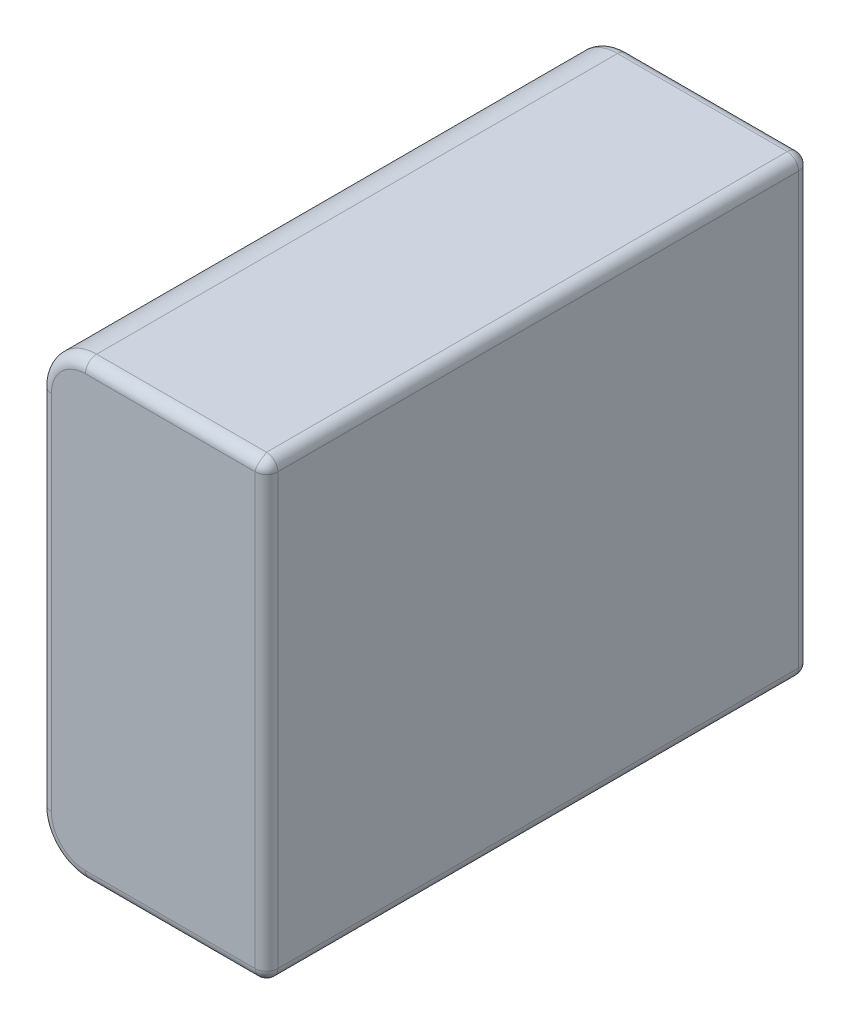
ISO-10303-21;
HEADER;
FILE_DESCRIPTION(('STEP AP214'),'2;1');
FILE_NAME('part.step','',(''),(''),'','','');
FILE_SCHEMA(('AUTOMOTIVE_DESIGN { 1 0 10303 214 1 1 1 1 }'));
ENDSEC;
DATA;
#1=APPLICATION_CONTEXT('core data for automotive mechanical design processes');
#2=APPLICATION_PROTOCOL_DEFINITION('international standard','automotive_design',2000,#1);
#3=PRODUCT_CONTEXT('',#1,'mechanical');
#4=PRODUCT('Part','Part','',(#3));
#5=PRODUCT_RELATED_PRODUCT_CATEGORY('part','',(#4));
#6=PRODUCT_DEFINITION_FORMATION('','',#4);
#7=PRODUCT_DEFINITION_CONTEXT('part definition',#1,'design');
#8=PRODUCT_DEFINITION('design','',#6,#7);
#9=PRODUCT_DEFINITION_SHAPE('','',#8);
#10=(LENGTH_UNIT() NAMED_UNIT(*) SI_UNIT(.MILLI.,.METRE.));
#11=(NAMED_UNIT(*) PLANE_ANGLE_UNIT() SI_UNIT($,.RADIAN.));
#12=(NAMED_UNIT(*) SI_UNIT($,.STERADIAN.) SOLID_ANGLE_UNIT());
#13=UNCERTAINTY_MEASURE_WITH_UNIT(LENGTH_MEASURE(1.E-05),#10,'distance_accuracy_value','');
#14=(GEOMETRIC_REPRESENTATION_CONTEXT(3) GLOBAL_UNCERTAINTY_ASSIGNED_CONTEXT((#13)) GLOBAL_UNIT_ASSIGNED_CONTEXT((#10,
#11,#12)) REPRESENTATION_CONTEXT('',''));
#15=CARTESIAN_POINT('',(0.,0.,0.));
#16=DIRECTION('',(0.,0.,1.));
#17=DIRECTION('',(1.,0.,0.));
#18=AXIS2_PLACEMENT_3D('',#15,#16,#17);
#19=CARTESIAN_POINT('',(-0.262499999999999,-0.125,0.587499999999999));
#20=DIRECTION('',(0.,1.,0.));
#21=DIRECTION('',(0.707106781186548,0.,0.707106781186548));
#22=AXIS2_PLACEMENT_3D('',#19,#20,#21);
#23=CYLINDRICAL_SURFACE('',#22,0.0125);
#24=CARTESIAN_POINT('',(-0.262499999999999,-0.2375,0.587499999999999));
#25=DIRECTION('',(0.,1.,0.));
#26=DIRECTION('',(0.,0.,1.));
#27=AXIS2_PLACEMENT_3D('',#24,#25,#26);
#28=CIRCLE('',#27,0.0125);
#29=CARTESIAN_POINT('',(-0.262499999999999,-0.2375,0.6));
#30=VERTEX_POINT('',#29);
#31=CARTESIAN_POINT('',(-0.25,-0.2375,0.587499999999999));
#32=VERTEX_POINT('',#31);
#33=EDGE_CURVE('E11',#30,#32,#28,.T.);
#34=ORIENTED_EDGE('',*,*,#33,.T.);
#35=DIRECTION('',(0.,1.,0.));
#36=VECTOR('',#35,1.);
#37=CARTESIAN_POINT('',(-0.25,-0.125,0.587499999999999));
#38=LINE('',#37,#36);
#39=CARTESIAN_POINT('',(-0.25,0.2375,0.587499999999999));
#40=VERTEX_POINT('',#39);
#41=EDGE_CURVE('E24',#32,#40,#38,.T.);
#42=ORIENTED_EDGE('',*,*,#41,.T.);
#43=CARTESIAN_POINT('',(-0.262500000000002,0.2375,0.587499999999999));
#44=DIRECTION('',(0.,-1.,0.));
#45=DIRECTION('',(1.,0.,0.));
#46=AXIS2_PLACEMENT_3D('',#43,#44,#45);
#47=CIRCLE('',#46,0.0125);
#48=CARTESIAN_POINT('',(-0.262500000000002,0.2375,0.6));
#49=VERTEX_POINT('',#48);
#50=EDGE_CURVE('E478',#40,#49,#47,.T.);
#51=ORIENTED_EDGE('',*,*,#50,.T.);
#52=DIRECTION('',(0.,-1.,0.));
#53=VECTOR('',#52,1.);
#54=CARTESIAN_POINT('',(-0.262499999999999,-0.125,0.6));
#55=LINE('',#54,#53);
#56=EDGE_CURVE('E480',#49,#30,#55,.T.);
#57=ORIENTED_EDGE('',*,*,#56,.T.);
#58=EDGE_LOOP('',(#34,#42,#51,#57));
#59=FACE_BOUND('',#58,.T.);
#60=ADVANCED_FACE('F17',(#59),#23,.T.);
#61=CARTESIAN_POINT('',(-0.262500000000002,0.2375,0.));
#62=DIRECTION('',(0.,0.,1.));
#63=DIRECTION('',(0.707106781186548,0.707106781186548,0.));
#64=AXIS2_PLACEMENT_3D('',#61,#62,#63);
#65=CYLINDRICAL_SURFACE('',#64,0.0125);
#66=CARTESIAN_POINT('',(-0.262500000000002,0.2375,0.0125));
#67=DIRECTION('',(0.,0.,1.));
#68=DIRECTION('',(1.,0.,0.));
#69=AXIS2_PLACEMENT_3D('',#66,#67,#68);
#70=CIRCLE('',#69,0.0125);
#71=CARTESIAN_POINT('',(-0.25,0.2375,0.0125));
#72=VERTEX_POINT('',#71);
#73=CARTESIAN_POINT('',(-0.262500000000002,0.25,0.0125));
#74=VERTEX_POINT('',#73);
#75=EDGE_CURVE('E328',#72,#74,#70,.T.);
#76=ORIENTED_EDGE('',*,*,#75,.T.);
#77=DIRECTION('',(0.,0.,1.));
#78=VECTOR('',#77,1.);
#79=CARTESIAN_POINT('',(-0.262500000000002,0.25,0.));
#80=LINE('',#79,#78);
#81=CARTESIAN_POINT('',(-0.262500000000002,0.25,0.587499999999999));
#82=VERTEX_POINT('',#81);
#83=EDGE_CURVE('E326',#74,#82,#80,.T.);
#84=ORIENTED_EDGE('',*,*,#83,.T.);
#85=CARTESIAN_POINT('',(-0.262500000000002,0.2375,0.587499999999999));
#86=DIRECTION('',(0.,0.,-1.));
#87=DIRECTION('',(0.,1.,0.));
#88=AXIS2_PLACEMENT_3D('',#85,#86,#87);
#89=CIRCLE('',#88,0.0125);
#90=EDGE_CURVE('E311',#82,#40,#89,.T.);
#91=ORIENTED_EDGE('',*,*,#90,.T.);
#92=DIRECTION('',(0.,0.,-1.));
#93=VECTOR('',#92,1.);
#94=CARTESIAN_POINT('',(-0.25,0.2375,0.));
#95=LINE('',#94,#93);
#96=EDGE_CURVE('E301',#40,#72,#95,.T.);
#97=ORIENTED_EDGE('',*,*,#96,.T.);
#98=EDGE_LOOP('',(#76,#84,#91,#97));
#99=FACE_BOUND('',#98,.T.);
#100=ADVANCED_FACE('F290',(#99),#65,.T.);
#101=CARTESIAN_POINT('',(-0.262500000000002,0.2375,0.587499999999999));
#102=DIRECTION('',(0.408248290463862,-0.816496580927725,0.408248290463866));
#103=DIRECTION('',(0.577350269189625,0.577350269189627,0.577350269189625));
#104=AXIS2_PLACEMENT_3D('',#101,#102,#103);
#105=SPHERICAL_SURFACE('',#104,0.0125);
#106=ORIENTED_EDGE('',*,*,#90,.F.);
#107=CARTESIAN_POINT('',(-0.262500000000002,0.25,0.587499999999999));
#108=CARTESIAN_POINT('',(-0.262460138317171,0.250000000368975,0.587587050235732));
#109=CARTESIAN_POINT('',(-0.262421203756531,0.249998900018879,0.587674523833041));
#110=CARTESIAN_POINT('',(-0.26234504080401,0.249994492376857,0.587850542882255));
#111=CARTESIAN_POINT('',(-0.262307819307045,0.249991176880227,0.587939091112898));
#112=CARTESIAN_POINT('',(-0.262235095454046,0.249982316901602,0.588117167164209));
#113=CARTESIAN_POINT('',(-0.262199600052556,0.249976764124813,0.588206697410652));
#114=CARTESIAN_POINT('',(-0.262130337871806,0.249963409840881,0.588386644833031));
#115=CARTESIAN_POINT('',(-0.262096578078579,0.249955599974056,0.588477064076424));
#116=CARTESIAN_POINT('',(-0.262030794145388,0.249937713377954,0.58865869603542));
#117=CARTESIAN_POINT('',(-0.261998776998999,0.249927628246524,0.588749910455609));
#118=CARTESIAN_POINT('',(-0.261936482752682,0.249905174938278,0.588933038355466));
#119=CARTESIAN_POINT('',(-0.26190621262967,0.249892798340192,0.589024953173915));
#120=CARTESIAN_POINT('',(-0.261847413889721,0.249865747441945,0.589209388185488));
#121=CARTESIAN_POINT('',(-0.261818892208327,0.249851064722725,0.589301909357091));
#122=CARTESIAN_POINT('',(-0.261763590279557,0.249819390038736,0.589487458151079));
#123=CARTESIAN_POINT('',(-0.261736816907599,0.249802389683842,0.589580486376875));
#124=CARTESIAN_POINT('',(-0.261658961292165,0.249747807237126,0.589860703073068));
#125=CARTESIAN_POINT('',(-0.261610664068412,0.249706791423579,0.59004801510688));
#126=CARTESIAN_POINT('',(-0.261520937759418,0.249615450455052,0.590423514884361));
#127=CARTESIAN_POINT('',(-0.261479561150397,0.249565059797937,0.590611699096358));
#128=CARTESIAN_POINT('',(-0.261403570620227,0.249454937117288,0.590988196284548));
#129=CARTESIAN_POINT('',(-0.261369006675153,0.249395141456735,0.591176500731737));
#130=CARTESIAN_POINT('',(-0.261306502098158,0.249266213002719,0.591552473817965));
#131=CARTESIAN_POINT('',(-0.261278608471858,0.249197019038733,0.591740129259613));
#132=CARTESIAN_POINT('',(-0.261229264257322,0.249049330723359,0.592114052021967));
#133=CARTESIAN_POINT('',(-0.261207857266753,0.248970778177699,0.592300302086986));
#134=CARTESIAN_POINT('',(-0.26117126850462,0.24880444368912,0.592670670223809));
#135=CARTESIAN_POINT('',(-0.261156126594544,0.248716606981504,0.592854767614381));
#136=CARTESIAN_POINT('',(-0.261131813442202,0.248531809467501,0.593220100228458));
#137=CARTESIAN_POINT('',(-0.261122678089061,0.248434797708901,0.59340131204606));
#138=CARTESIAN_POINT('',(-0.261110088515226,0.248231790024816,0.593760159765119));
#139=CARTESIAN_POINT('',(-0.261106666071686,0.248125747272619,0.593937770271813));
#140=CARTESIAN_POINT('',(-0.261105179530546,0.247904852225839,0.594288721361308));
#141=CARTESIAN_POINT('',(-0.261107143051624,0.247789957471335,0.594462035319713));
#142=CARTESIAN_POINT('',(-0.261116074367314,0.247551567669741,0.594803722087146));
#143=CARTESIAN_POINT('',(-0.261123065665332,0.247428034699039,0.594972067809081));
#144=CARTESIAN_POINT('',(-0.261141669295437,0.247172612106419,0.595303172639523));
#145=CARTESIAN_POINT('',(-0.261153301143513,0.247040689195444,0.595465904959755));
#146=CARTESIAN_POINT('',(-0.261180775747745,0.246768764364797,0.595785166124085));
#147=CARTESIAN_POINT('',(-0.261196634239012,0.246628733818788,0.595941669222561));
#148=CARTESIAN_POINT('',(-0.261232127542683,0.246340904812075,0.596247886384845));
#149=CARTESIAN_POINT('',(-0.261251774587734,0.24619308234755,0.596397576460868));
#150=CARTESIAN_POINT('',(-0.261294388510575,0.245890013342245,0.596689615871231));
#151=CARTESIAN_POINT('',(-0.261317364461382,0.245734747313759,0.596831943652332));
#152=CARTESIAN_POINT('',(-0.261366160485632,0.245417166900696,0.59710874299751));
#153=CARTESIAN_POINT('',(-0.261391986871758,0.245254837374504,0.597243196072397));
#154=CARTESIAN_POINT('',(-0.261445991620957,0.244923536552346,0.59750376896212));
#155=CARTESIAN_POINT('',(-0.261474173983779,0.244754554230126,0.597629873926419));
#156=CARTESIAN_POINT('',(-0.26153238498295,0.244410384103418,0.59787331399446));
#157=CARTESIAN_POINT('',(-0.261562415792964,0.244235189099866,0.597990638399316));
#158=CARTESIAN_POINT('',(-0.26162380737987,0.243879058289113,0.598216123000334));
#159=CARTESIAN_POINT('',(-0.261655169021759,0.24369811876801,0.598324277094838));
#160=CARTESIAN_POINT('',(-0.261718698378142,0.243330990541526,0.598531070579969));
#161=CARTESIAN_POINT('',(-0.261750866187902,0.243144801215446,0.598629708839366));
#162=CARTESIAN_POINT('',(-0.261815479459071,0.242767690354468,0.598817165396053));
#163=CARTESIAN_POINT('',(-0.261847924797288,0.24257677085445,0.59890598782922));
#164=CARTESIAN_POINT('',(-0.261912563267763,0.242190740263042,0.599073553871494));
#165=CARTESIAN_POINT('',(-0.261944756612733,0.241995633383472,0.599152307100366));
#166=CARTESIAN_POINT('',(-0.26200836290602,0.241601790460795,0.599299523203508));
#167=CARTESIAN_POINT('',(-0.262039776951108,0.241403060291862,0.599368001315687));
#168=CARTESIAN_POINT('',(-0.262101301219288,0.241002553067784,0.599494503671092));
#169=CARTESIAN_POINT('',(-0.262131413955845,0.240800783004186,0.599552548820256));
#170=CARTESIAN_POINT('',(-0.262189820033099,0.240394796106706,0.599658070264641));
#171=CARTESIAN_POINT('',(-0.262218117811786,0.240190586812288,0.599705573098087));
#172=CARTESIAN_POINT('',(-0.262272389274939,0.239780337089305,0.599789943490852));
#173=CARTESIAN_POINT('',(-0.262298369795825,0.239574304161341,0.599826843099588));
#174=CARTESIAN_POINT('',(-0.262347515991668,0.239161036698738,0.599889989875639));
#175=CARTESIAN_POINT('',(-0.262370691332091,0.238953809026519,0.599916274394815));
#176=CARTESIAN_POINT('',(-0.262413752999642,0.238538790892885,0.599958220217014));
#177=CARTESIAN_POINT('',(-0.262433652201096,0.238331006062188,0.599973923891259));
#178=CARTESIAN_POINT('',(-0.262469707922112,0.237915527781207,0.599994792829387));
#179=CARTESIAN_POINT('',(-0.262485880839781,0.237707838106917,0.600000005078491));
#180=CARTESIAN_POINT('',(-0.262500000000002,0.2375,0.6));
#181=B_SPLINE_CURVE_WITH_KNOTS('',3,(#107,#108,#109,#110,#111,#112,#113,#114,#115,#116,#117,
#118,#119,#120,#121,#122,#123,#124,#125,#126,#127,#128,#129,#130,#131,#132,#133,#134,#135,#136,
#137,#138,#139,#140,#141,#142,#143,#144,#145,#146,#147,#148,#149,#150,#151,#152,#153,#154,#155,
#156,#157,#158,#159,#160,#161,#162,#163,#164,#165,#166,#167,#168,#169,#170,#171,#172,#173,#174,
#175,#176,#177,#178,#179,#180),.UNSPECIFIED.,.F.,.F.,(4,2,2,2,2,2,2,2,2,2,2,2,2,2,2,2,2,2,2,2,2,
2,2,2,2,2,2,2,2,2,2,2,2,2,2,2,4),(0.,0.000287215319437022,0.000575500400044878,
0.000864864290064689,0.00115531395410053,0.00144685428334177,0.00173948810969325,
0.00203321622360352,0.00232803739539121,0.00292087989864206,0.00351803175637727,
0.0041194132520295,0.00472491540580101,0.00533440129988855,0.00594770752489346,
0.00656464572958198,0.00718500425813863,0.00780854986095383,0.008435029466779,
0.00906417200571993,0.00969569027402575,0.010329282832943,0.0109646359350514,0.0116014254724792,
0.0122393189422204,0.012877977424449,0.0135170575702609,0.0141562135956687,0.0147950992789479,
0.0154333699585787,0.0160706845290551,0.0167067074317385,0.0173411106377146,0.0179735756192771,
0.0186037953061802,0.0192314760221985,0.0198563393967707),.UNSPECIFIED.);
#182=EDGE_CURVE('E273',#82,#49,#181,.T.);
#183=ORIENTED_EDGE('',*,*,#182,.T.);
#184=ORIENTED_EDGE('',*,*,#50,.F.);
#185=EDGE_LOOP('',(#106,#183,#184));
#186=FACE_BOUND('',#185,.T.);
#187=ADVANCED_FACE('F280',(#186),#105,.T.);
#188=CARTESIAN_POINT('',(-0.262499999999999,-0.125,0.0125));
#189=DIRECTION('',(0.,1.,0.));
#190=DIRECTION('',(0.707106781186548,0.,-0.707106781186547));
#191=AXIS2_PLACEMENT_3D('',#188,#189,#190);
#192=CYLINDRICAL_SURFACE('',#191,0.0125);
#193=CARTESIAN_POINT('',(-0.262499999999999,-0.2375,0.0125));
#194=DIRECTION('',(0.,1.,0.));
#195=DIRECTION('',(1.,0.,0.));
#196=AXIS2_PLACEMENT_3D('',#193,#194,#195);
#197=CIRCLE('',#196,0.0125);
#198=CARTESIAN_POINT('',(-0.25,-0.2375,0.0125));
#199=VERTEX_POINT('',#198);
#200=CARTESIAN_POINT('',(-0.262499999999999,-0.2375,0.));
#201=VERTEX_POINT('',#200);
#202=EDGE_CURVE('E381',#199,#201,#197,.T.);
#203=ORIENTED_EDGE('',*,*,#202,.T.);
#204=DIRECTION('',(0.,1.,0.));
#205=VECTOR('',#204,1.);
#206=CARTESIAN_POINT('',(-0.262499999999999,-0.125,0.));
#207=LINE('',#206,#205);
#208=CARTESIAN_POINT('',(-0.262500000000002,0.2375,0.));
#209=VERTEX_POINT('',#208);
#210=EDGE_CURVE('E379',#201,#209,#207,.T.);
#211=ORIENTED_EDGE('',*,*,#210,.T.);
#212=CARTESIAN_POINT('',(-0.262499999999999,0.2375,0.0125));
#213=DIRECTION('',(0.,-1.,0.));
#214=DIRECTION('',(-1.95156391047391E-13,0.,-1.));
#215=AXIS2_PLACEMENT_3D('',#212,#213,#214);
#216=CIRCLE('',#215,0.0125);
#217=EDGE_CURVE('E363',#209,#72,#216,.T.);
#218=ORIENTED_EDGE('',*,*,#217,.T.);
#219=DIRECTION('',(0.,-1.,0.));
#220=VECTOR('',#219,1.);
#221=CARTESIAN_POINT('',(-0.25,-0.125,0.0125));
#222=LINE('',#221,#220);
#223=EDGE_CURVE('E352',#72,#199,#222,.T.);
#224=ORIENTED_EDGE('',*,*,#223,.T.);
#225=EDGE_LOOP('',(#203,#211,#218,#224));
#226=FACE_BOUND('',#225,.T.);
#227=ADVANCED_FACE('F289',(#226),#192,.T.);
#228=CARTESIAN_POINT('',(-0.262500000000002,0.2375,0.0125));
#229=DIRECTION('',(-0.816496580927726,0.408248290463863,-0.408248290463864));
#230=DIRECTION('',(0.577350269189626,0.577350269189626,-0.577350269189626));
#231=AXIS2_PLACEMENT_3D('',#228,#229,#230);
#232=SPHERICAL_SURFACE('',#231,0.0125);
#233=ORIENTED_EDGE('',*,*,#217,.F.);
#234=CARTESIAN_POINT('',(-0.262500000000002,0.2375,0.0125));
#235=DIRECTION('',(1.,0.,0.));
#236=DIRECTION('',(0.,0.707106781186548,-0.707106781186547));
#237=AXIS2_PLACEMENT_3D('',#234,#235,#236);
#238=CIRCLE('',#237,0.0125);
#239=EDGE_CURVE('E430',#209,#74,#238,.T.);
#240=ORIENTED_EDGE('',*,*,#239,.T.);
#241=ORIENTED_EDGE('',*,*,#75,.F.);
#242=EDGE_LOOP('',(#233,#240,#241));
#243=FACE_BOUND('',#242,.T.);
#244=ADVANCED_FACE('F333',(#243),#232,.T.);
#245=CARTESIAN_POINT('',(-0.262499999999999,-0.2375,0.));
#246=DIRECTION('',(0.,0.,1.));
#247=DIRECTION('',(0.707106781186548,-0.707106781186548,0.));
#248=AXIS2_PLACEMENT_3D('',#245,#246,#247);
#249=CYLINDRICAL_SURFACE('',#248,0.0125);
#250=CARTESIAN_POINT('',(-0.262499999999999,-0.2375,0.0125));
#251=DIRECTION('',(0.,0.,1.));
#252=DIRECTION('',(0.,-1.,0.));
#253=AXIS2_PLACEMENT_3D('',#250,#251,#252);
#254=CIRCLE('',#253,0.0125);
#255=CARTESIAN_POINT('',(-0.262499999999999,-0.25,0.0125));
#256=VERTEX_POINT('',#255);
#257=EDGE_CURVE('E414',#256,#199,#254,.T.);
#258=ORIENTED_EDGE('',*,*,#257,.T.);
#259=DIRECTION('',(0.,0.,1.));
#260=VECTOR('',#259,1.);
#261=CARTESIAN_POINT('',(-0.25,-0.2375,0.));
#262=LINE('',#261,#260);
#263=EDGE_CURVE('E404',#199,#32,#262,.T.);
#264=ORIENTED_EDGE('',*,*,#263,.T.);
#265=CARTESIAN_POINT('',(-0.262499999999999,-0.2375,0.587499999999999));
#266=DIRECTION('',(0.,0.,-1.));
#267=DIRECTION('',(1.,0.,0.));
#268=AXIS2_PLACEMENT_3D('',#265,#266,#267);
#269=CIRCLE('',#268,0.0125);
#270=CARTESIAN_POINT('',(-0.262499999999999,-0.25,0.587499999999999));
#271=VERTEX_POINT('',#270);
#272=EDGE_CURVE('E432',#32,#271,#269,.T.);
#273=ORIENTED_EDGE('',*,*,#272,.T.);
#274=DIRECTION('',(0.,0.,-1.));
#275=VECTOR('',#274,1.);
#276=CARTESIAN_POINT('',(-0.262499999999999,-0.25,0.));
#277=LINE('',#276,#275);
#278=EDGE_CURVE('E433',#271,#256,#277,.T.);
#279=ORIENTED_EDGE('',*,*,#278,.T.);
#280=EDGE_LOOP('',(#258,#264,#273,#279));
#281=FACE_BOUND('',#280,.T.);
#282=ADVANCED_FACE('F342',(#281),#249,.T.);
#283=CARTESIAN_POINT('',(-0.262499999999999,-0.2375,0.0125));
#284=DIRECTION('',(-0.816496580927726,-0.408248290463863,-0.408248290463864));
#285=DIRECTION('',(0.577350269189626,-0.577350269189626,-0.577350269189626));
#286=AXIS2_PLACEMENT_3D('',#283,#284,#285);
#287=SPHERICAL_SURFACE('',#286,0.0125);
#288=ORIENTED_EDGE('',*,*,#257,.F.);
#289=CARTESIAN_POINT('',(-0.262499999999999,-0.2375,0.0125));
#290=DIRECTION('',(1.,0.,0.));
#291=DIRECTION('',(0.,-0.707106781186548,-0.707106781186547));
#292=AXIS2_PLACEMENT_3D('',#289,#290,#291);
#293=CIRCLE('',#292,0.0125);
#294=EDGE_CURVE('E436',#256,#201,#293,.T.);
#295=ORIENTED_EDGE('',*,*,#294,.T.);
#296=ORIENTED_EDGE('',*,*,#202,.F.);
#297=EDGE_LOOP('',(#288,#295,#296));
#298=FACE_BOUND('',#297,.T.);
#299=ADVANCED_FACE('F385',(#298),#287,.T.);
#300=CARTESIAN_POINT('',(-0.262499999999999,-0.2375,0.587499999999999));
#301=DIRECTION('',(-0.408248290463862,-0.816496580927728,-0.408248290463859));
#302=DIRECTION('',(0.577350269189628,-0.577350269189623,0.577350269189628));
#303=AXIS2_PLACEMENT_3D('',#300,#301,#302);
#304=SPHERICAL_SURFACE('',#303,0.0125);
#305=ORIENTED_EDGE('',*,*,#33,.F.);
#306=CARTESIAN_POINT('',(-0.262499999999999,-0.2375,0.6));
#307=CARTESIAN_POINT('',(-0.262485880839779,-0.237707838106917,0.600000005078491));
#308=CARTESIAN_POINT('',(-0.26246970792211,-0.237915527781207,0.599994792829387));
#309=CARTESIAN_POINT('',(-0.262433652201093,-0.238331006062188,0.599973923891259));
#310=CARTESIAN_POINT('',(-0.262413752999639,-0.238538790892885,0.599958220217014));
#311=CARTESIAN_POINT('',(-0.262370691332088,-0.238953809026519,0.599916274394815));
#312=CARTESIAN_POINT('',(-0.262347515991665,-0.239161036698738,0.599889989875639));
#313=CARTESIAN_POINT('',(-0.262298369795822,-0.239574304161341,0.599826843099588));
#314=CARTESIAN_POINT('',(-0.262272389274936,-0.239780337089305,0.599789943490852));
#315=CARTESIAN_POINT('',(-0.262218117811784,-0.240190586812288,0.599705573098086));
#316=CARTESIAN_POINT('',(-0.262189820033097,-0.240394796106706,0.599658070264641));
#317=CARTESIAN_POINT('',(-0.262131413955842,-0.240800783004186,0.599552548820255));
#318=CARTESIAN_POINT('',(-0.262101301219286,-0.241002553067784,0.599494503671092));
#319=CARTESIAN_POINT('',(-0.262039776951105,-0.241403060291862,0.599368001315687));
#320=CARTESIAN_POINT('',(-0.262008362906018,-0.241601790460795,0.599299523203508));
#321=CARTESIAN_POINT('',(-0.26194475661273,-0.241995633383472,0.599152307100366));
#322=CARTESIAN_POINT('',(-0.26191256326776,-0.242190740263043,0.599073553871494));
#323=CARTESIAN_POINT('',(-0.261847924797286,-0.242576770854451,0.59890598782922));
#324=CARTESIAN_POINT('',(-0.261815479459068,-0.242767690354469,0.598817165396053));
#325=CARTESIAN_POINT('',(-0.261750866187899,-0.243144801215446,0.598629708839366));
#326=CARTESIAN_POINT('',(-0.26171869837814,-0.243330990541526,0.598531070579969));
#327=CARTESIAN_POINT('',(-0.261655169021756,-0.243698118768011,0.598324277094838));
#328=CARTESIAN_POINT('',(-0.261623807379867,-0.243879058289113,0.598216123000334));
#329=CARTESIAN_POINT('',(-0.261562415792962,-0.244235189099866,0.597990638399316));
#330=CARTESIAN_POINT('',(-0.261532384982948,-0.244410384103418,0.59787331399446));
#331=CARTESIAN_POINT('',(-0.261474173983776,-0.244754554230126,0.597629873926419));
#332=CARTESIAN_POINT('',(-0.261445991620955,-0.244923536552346,0.59750376896212));
#333=CARTESIAN_POINT('',(-0.261391986871755,-0.245254837374505,0.597243196072397));
#334=CARTESIAN_POINT('',(-0.26136616048563,-0.245417166900697,0.59710874299751));
#335=CARTESIAN_POINT('',(-0.261317364461379,-0.245734747313759,0.596831943652332));
#336=CARTESIAN_POINT('',(-0.261294388510572,-0.245890013342245,0.596689615871231));
#337=CARTESIAN_POINT('',(-0.261251774587731,-0.246193082347551,0.596397576460868));
#338=CARTESIAN_POINT('',(-0.26123212754268,-0.246340904812075,0.596247886384845));
#339=CARTESIAN_POINT('',(-0.261196634239009,-0.246628733818788,0.595941669222561));
#340=CARTESIAN_POINT('',(-0.261180775747742,-0.246768764364797,0.595785166124085));
#341=CARTESIAN_POINT('',(-0.261153301143511,-0.247040689195444,0.595465904959755));
#342=CARTESIAN_POINT('',(-0.261141669295434,-0.247172612106419,0.595303172639523));
#343=CARTESIAN_POINT('',(-0.261123065665329,-0.247428034699039,0.594972067809081));
#344=CARTESIAN_POINT('',(-0.261116074367311,-0.247551567669741,0.594803722087146));
#345=CARTESIAN_POINT('',(-0.261107143051622,-0.247789957471335,0.594462035319713));
#346=CARTESIAN_POINT('',(-0.261105179530543,-0.247904852225839,0.594288721361308));
#347=CARTESIAN_POINT('',(-0.261106666071684,-0.248125747272619,0.593937770271813));
#348=CARTESIAN_POINT('',(-0.261110088515223,-0.248231790024816,0.593760159765119));
#349=CARTESIAN_POINT('',(-0.261122678089058,-0.248434797708902,0.59340131204606));
#350=CARTESIAN_POINT('',(-0.261131813442199,-0.248531809467501,0.593220100228458));
#351=CARTESIAN_POINT('',(-0.261156126594541,-0.248716606981504,0.592854767614381));
#352=CARTESIAN_POINT('',(-0.261171268504618,-0.24880444368912,0.592670670223809));
#353=CARTESIAN_POINT('',(-0.261207857266751,-0.248970778177699,0.592300302086986));
#354=CARTESIAN_POINT('',(-0.26122926425732,-0.249049330723359,0.592114052021967));
#355=CARTESIAN_POINT('',(-0.261278608471855,-0.249197019038733,0.591740129259613));
#356=CARTESIAN_POINT('',(-0.261306502098155,-0.249266213002719,0.591552473817965));
#357=CARTESIAN_POINT('',(-0.261369006675151,-0.249395141456736,0.591176500731737));
#358=CARTESIAN_POINT('',(-0.261403570620224,-0.249454937117288,0.590988196284548));
#359=CARTESIAN_POINT('',(-0.261479561150395,-0.249565059797937,0.590611699096358));
#360=CARTESIAN_POINT('',(-0.261520937759416,-0.249615450455052,0.590423514884361));
#361=CARTESIAN_POINT('',(-0.261610664068409,-0.249706791423579,0.59004801510688));
#362=CARTESIAN_POINT('',(-0.261658961292163,-0.249747807237126,0.589860703073068));
#363=CARTESIAN_POINT('',(-0.261736816907597,-0.249802389683843,0.589580486376875));
#364=CARTESIAN_POINT('',(-0.261763590279555,-0.249819390038736,0.589487458151079));
#365=CARTESIAN_POINT('',(-0.261818892208325,-0.249851064722725,0.589301909357091));
#366=CARTESIAN_POINT('',(-0.261847413889718,-0.249865747441945,0.589209388185488));
#367=CARTESIAN_POINT('',(-0.261906212629667,-0.249892798340192,0.589024953173915));
#368=CARTESIAN_POINT('',(-0.26193648275268,-0.249905174938279,0.588933038355466));
#369=CARTESIAN_POINT('',(-0.261998776998996,-0.249927628246524,0.588749910455609));
#370=CARTESIAN_POINT('',(-0.262030794145385,-0.249937713377954,0.58865869603542));
#371=CARTESIAN_POINT('',(-0.262096578078576,-0.249955599974056,0.588477064076424));
#372=CARTESIAN_POINT('',(-0.262130337871804,-0.249963409840881,0.588386644833031));
#373=CARTESIAN_POINT('',(-0.262199600052554,-0.249976764124813,0.588206697410652));
#374=CARTESIAN_POINT('',(-0.262235095454043,-0.249982316901603,0.588117167164209));
#375=CARTESIAN_POINT('',(-0.262307819307043,-0.249991176880228,0.587939091112898));
#376=CARTESIAN_POINT('',(-0.262345040804008,-0.249994492376857,0.587850542882255));
#377=CARTESIAN_POINT('',(-0.262421203756528,-0.24999890001888,0.587674523833041));
#378=CARTESIAN_POINT('',(-0.262460138317169,-0.250000000368976,0.587587050235733));
#379=CARTESIAN_POINT('',(-0.262499999999999,-0.25,0.587499999999999));
#380=B_SPLINE_CURVE_WITH_KNOTS('',3,(#306,#307,#308,#309,#310,#311,#312,#313,#314,#315,#316,
#317,#318,#319,#320,#321,#322,#323,#324,#325,#326,#327,#328,#329,#330,#331,#332,#333,#334,#335,
#336,#337,#338,#339,#340,#341,#342,#343,#344,#345,#346,#347,#348,#349,#350,#351,#352,#353,#354,
#355,#356,#357,#358,#359,#360,#361,#362,#363,#364,#365,#366,#367,#368,#369,#370,#371,#372,#373,
#374,#375,#376,#377,#378,#379),.UNSPECIFIED.,.F.,.F.,(4,2,2,2,2,2,2,2,2,2,2,2,2,2,2,2,2,2,2,2,2,
2,2,2,2,2,2,2,2,2,2,2,2,2,2,2,4),(0.,0.000624863374572158,0.00125254409059044,
0.00188276377749354,0.00251522875905604,0.00314963196503219,0.00378565486771549,
0.00442296943819198,0.00506124011782273,0.00570012580110189,0.00633928182650971,
0.00697836197232162,0.00761702045455022,0.00825491392429133,0.00889170346171915,
0.0095270565638276,0.0101606491227448,0.0107921673910506,0.0114213099299916,0.0120477895358168,
0.012671335138632,0.0132916936671886,0.0139086318718771,0.014521938096882,0.0151314239909696,
0.0157369261447411,0.0163383076403933,0.0169354594981285,0.0175283020013794,0.0178231231731671,
0.0181168512870773,0.0184094851134287,0.01870102544267,0.0189914751067058,0.0192808389967257,
0.0195691240773335,0.0198563393967706),.UNSPECIFIED.);
#381=EDGE_CURVE('E138',#30,#271,#380,.T.);
#382=ORIENTED_EDGE('',*,*,#381,.T.);
#383=ORIENTED_EDGE('',*,*,#272,.F.);
#384=EDGE_LOOP('',(#305,#382,#383));
#385=FACE_BOUND('',#384,.T.);
#386=ADVANCED_FACE('F394',(#385),#304,.T.);
#387=CARTESIAN_POINT('',(-0.3125,0.2375,0.0125));
#388=DIRECTION('',(-1.,0.,0.));
#389=DIRECTION('',(0.,0.707106781186548,-0.707106781186547));
#390=AXIS2_PLACEMENT_3D('',#387,#388,#389);
#391=CYLINDRICAL_SURFACE('',#390,0.0125);
#392=ORIENTED_EDGE('',*,*,#239,.F.);
#393=DIRECTION('',(-1.,0.,0.));
#394=VECTOR('',#393,1.);
#395=CARTESIAN_POINT('',(-0.3125,0.2375,0.));
#396=LINE('',#395,#394);
#397=CARTESIAN_POINT('',(-0.450000000000001,0.2375,0.));
#398=VERTEX_POINT('',#397);
#399=EDGE_CURVE('E225',#209,#398,#396,.T.);
#400=ORIENTED_EDGE('',*,*,#399,.T.);
#401=CARTESIAN_POINT('',(-0.450000000000001,0.2375,0.0125));
#402=DIRECTION('',(1.,0.,0.));
#403=DIRECTION('',(0.,0.,-1.));
#404=AXIS2_PLACEMENT_3D('',#401,#402,#403);
#405=CIRCLE('',#404,0.0125);
#406=CARTESIAN_POINT('',(-0.450000000000001,0.25,0.0125));
#407=VERTEX_POINT('',#406);
#408=EDGE_CURVE('E223',#398,#407,#405,.T.);
#409=ORIENTED_EDGE('',*,*,#408,.T.);
#410=DIRECTION('',(1.,0.,0.));
#411=VECTOR('',#410,1.);
#412=CARTESIAN_POINT('',(-0.3125,0.25,0.0125));
#413=LINE('',#412,#411);
#414=EDGE_CURVE('E218',#407,#74,#413,.T.);
#415=ORIENTED_EDGE('',*,*,#414,.T.);
#416=EDGE_LOOP('',(#392,#400,#409,#415));
#417=FACE_BOUND('',#416,.T.);
#418=ADVANCED_FACE('F526',(#417),#391,.T.);
#419=CARTESIAN_POINT('',(-0.375000000000001,0.,0.));
#420=DIRECTION('',(0.,0.,1.));
#421=DIRECTION('',(1.,0.,0.));
#422=AXIS2_PLACEMENT_3D('',#419,#420,#421);
#423=PLANE('',#422);
#424=ORIENTED_EDGE('',*,*,#210,.F.);
#425=DIRECTION('',(1.,0.,0.));
#426=VECTOR('',#425,1.);
#427=CARTESIAN_POINT('',(-0.412500000000001,-0.2375,0.));
#428=LINE('',#427,#426);
#429=CARTESIAN_POINT('',(-0.450000000000001,-0.237500000000001,0.));
#430=VERTEX_POINT('',#429);
#431=EDGE_CURVE('E213',#430,#201,#428,.T.);
#432=ORIENTED_EDGE('',*,*,#431,.F.);
#433=CARTESIAN_POINT('',(-0.450000000000001,-0.2,0.));
#434=DIRECTION('',(0.,0.,1.));
#435=DIRECTION('',(-0.707106781186547,-0.707106781186548,0.));
#436=AXIS2_PLACEMENT_3D('',#433,#434,#435);
#437=CIRCLE('',#436,0.0375000000000014);
#438=CARTESIAN_POINT('',(-0.487500000000001,-0.2,0.));
#439=VERTEX_POINT('',#438);
#440=EDGE_CURVE('E210',#439,#430,#437,.T.);
#441=ORIENTED_EDGE('',*,*,#440,.F.);
#442=DIRECTION('',(0.,-1.,0.));
#443=VECTOR('',#442,1.);
#444=CARTESIAN_POINT('',(-0.487500000000001,0.0999999999999995,0.));
#445=LINE('',#444,#443);
#446=CARTESIAN_POINT('',(-0.487500000000001,0.2,0.));
#447=VERTEX_POINT('',#446);
#448=EDGE_CURVE('E207',#447,#439,#445,.T.);
#449=ORIENTED_EDGE('',*,*,#448,.F.);
#450=CARTESIAN_POINT('',(-0.450000000000001,0.2,0.));
#451=DIRECTION('',(0.,0.,1.));
#452=DIRECTION('',(-0.707106781186548,0.707106781186548,0.));
#453=AXIS2_PLACEMENT_3D('',#450,#451,#452);
#454=CIRCLE('',#453,0.0375000000000006);
#455=EDGE_CURVE('E204',#398,#447,#454,.T.);
#456=ORIENTED_EDGE('',*,*,#455,.F.);
#457=ORIENTED_EDGE('',*,*,#399,.F.);
#458=EDGE_LOOP('',(#424,#432,#441,#449,#456,#457));
#459=FACE_BOUND('',#458,.T.);
#460=ADVANCED_FACE('F520',(#459),#423,.F.);
#461=CARTESIAN_POINT('',(-0.412500000000001,-0.2375,0.0125));
#462=DIRECTION('',(1.,0.,0.));
#463=DIRECTION('',(0.,-0.707106781186548,-0.707106781186547));
#464=AXIS2_PLACEMENT_3D('',#461,#462,#463);
#465=CYLINDRICAL_SURFACE('',#464,0.0125);
#466=ORIENTED_EDGE('',*,*,#294,.F.);
#467=DIRECTION('',(-1.,0.,0.));
#468=VECTOR('',#467,1.);
#469=CARTESIAN_POINT('',(-0.412500000000001,-0.25,0.0125));
#470=LINE('',#469,#468);
#471=CARTESIAN_POINT('',(-0.450000000000001,-0.25,0.0125));
#472=VERTEX_POINT('',#471);
#473=EDGE_CURVE('E200',#256,#472,#470,.T.);
#474=ORIENTED_EDGE('',*,*,#473,.T.);
#475=CARTESIAN_POINT('',(-0.450000000000001,-0.237500000000001,0.0125));
#476=DIRECTION('',(-1.,0.,0.));
#477=DIRECTION('',(0.,0.,-1.));
#478=AXIS2_PLACEMENT_3D('',#475,#476,#477);
#479=CIRCLE('',#478,0.0125);
#480=EDGE_CURVE('E197',#430,#472,#479,.T.);
#481=ORIENTED_EDGE('',*,*,#480,.F.);
#482=ORIENTED_EDGE('',*,*,#431,.T.);
#483=EDGE_LOOP('',(#466,#474,#481,#482));
#484=FACE_BOUND('',#483,.T.);
#485=ADVANCED_FACE('F474',(#484),#465,.T.);
#486=CARTESIAN_POINT('',(-0.450000000000001,-0.25,0.));
#487=DIRECTION('',(0.,-1.,0.));
#488=DIRECTION('',(1.,0.,0.));
#489=AXIS2_PLACEMENT_3D('',#486,#487,#488);
#490=PLANE('',#489);
#491=ORIENTED_EDGE('',*,*,#278,.F.);
#492=DIRECTION('',(1.,0.,0.));
#493=VECTOR('',#492,1.);
#494=CARTESIAN_POINT('',(-0.412500000000001,-0.25,0.587499999999999));
#495=LINE('',#494,#493);
#496=CARTESIAN_POINT('',(-0.450000000000001,-0.25,0.587499999999999));
#497=VERTEX_POINT('',#496);
#498=EDGE_CURVE('E193',#497,#271,#495,.T.);
#499=ORIENTED_EDGE('',*,*,#498,.F.);
#500=DIRECTION('',(0.,0.,1.));
#501=VECTOR('',#500,1.);
#502=CARTESIAN_POINT('',(-0.450000000000001,-0.25,0.));
#503=LINE('',#502,#501);
#504=EDGE_CURVE('E190',#472,#497,#503,.T.);
#505=ORIENTED_EDGE('',*,*,#504,.F.);
#506=ORIENTED_EDGE('',*,*,#473,.F.);
#507=EDGE_LOOP('',(#491,#499,#505,#506));
#508=FACE_BOUND('',#507,.T.);
#509=ADVANCED_FACE('F464',(#508),#490,.T.);
#510=CARTESIAN_POINT('',(-0.25,-0.25,0.));
#511=DIRECTION('',(1.,0.,0.));
#512=DIRECTION('',(0.,1.,0.));
#513=AXIS2_PLACEMENT_3D('',#510,#511,#512);
#514=PLANE('',#513);
#515=ORIENTED_EDGE('',*,*,#41,.F.);
#516=ORIENTED_EDGE('',*,*,#263,.F.);
#517=ORIENTED_EDGE('',*,*,#223,.F.);
#518=ORIENTED_EDGE('',*,*,#96,.F.);
#519=EDGE_LOOP('',(#515,#516,#517,#518));
#520=FACE_BOUND('',#519,.T.);
#521=ADVANCED_FACE('F477',(#520),#514,.T.);
#522=CARTESIAN_POINT('',(-0.450000000000001,0.2,0.0125));
#523=DIRECTION('',(0.,0.,1.));
#524=DIRECTION('',(1.,0.,0.));
#525=AXIS2_PLACEMENT_3D('',#522,#523,#524);
#526=TOROIDAL_SURFACE('',#525,0.0375000000000006,0.0125);
#527=CARTESIAN_POINT('',(-0.487500000000001,0.2,0.0125));
#528=DIRECTION('',(0.,1.,0.));
#529=DIRECTION('',(0.,0.,-1.));
#530=AXIS2_PLACEMENT_3D('',#527,#528,#529);
#531=CIRCLE('',#530,0.0125);
#532=CARTESIAN_POINT('',(-0.499999999999999,0.2,0.0125));
#533=VERTEX_POINT('',#532);
#534=EDGE_CURVE('E188',#447,#533,#531,.T.);
#535=ORIENTED_EDGE('',*,*,#534,.T.);
#536=CARTESIAN_POINT('',(-0.450000000000001,0.2,0.0125));
#537=DIRECTION('',(0.,0.,-1.));
#538=DIRECTION('',(-0.707106781186548,0.707106781186548,0.));
#539=AXIS2_PLACEMENT_3D('',#536,#537,#538);
#540=CIRCLE('',#539,0.0500000000000007);
#541=EDGE_CURVE('E185',#533,#407,#540,.T.);
#542=ORIENTED_EDGE('',*,*,#541,.T.);
#543=ORIENTED_EDGE('',*,*,#408,.F.);
#544=ORIENTED_EDGE('',*,*,#455,.T.);
#545=EDGE_LOOP('',(#535,#542,#543,#544));
#546=FACE_BOUND('',#545,.T.);
#547=ADVANCED_FACE('F524',(#546),#526,.T.);
#548=CARTESIAN_POINT('',(-0.487500000000001,0.0999999999999995,0.0125));
#549=DIRECTION('',(0.,-1.,0.));
#550=DIRECTION('',(-0.707106781186548,0.,-0.707106781186547));
#551=AXIS2_PLACEMENT_3D('',#548,#549,#550);
#552=CYLINDRICAL_SURFACE('',#551,0.0125);
#553=CARTESIAN_POINT('',(-0.487500000000001,-0.2,0.0125));
#554=DIRECTION('',(0.,1.,0.));
#555=DIRECTION('',(0.,0.,-1.));
#556=AXIS2_PLACEMENT_3D('',#553,#554,#555);
#557=CIRCLE('',#556,0.0125);
#558=CARTESIAN_POINT('',(-0.499999999999999,-0.2,0.0125));
#559=VERTEX_POINT('',#558);
#560=EDGE_CURVE('E183',#439,#559,#557,.T.);
#561=ORIENTED_EDGE('',*,*,#560,.T.);
#562=DIRECTION('',(0.,1.,0.));
#563=VECTOR('',#562,1.);
#564=CARTESIAN_POINT('',(-0.499999999999999,0.0999999999999995,0.0125));
#565=LINE('',#564,#563);
#566=EDGE_CURVE('E180',#559,#533,#565,.T.);
#567=ORIENTED_EDGE('',*,*,#566,.T.);
#568=ORIENTED_EDGE('',*,*,#534,.F.);
#569=ORIENTED_EDGE('',*,*,#448,.T.);
#570=EDGE_LOOP('',(#561,#567,#568,#569));
#571=FACE_BOUND('',#570,.T.);
#572=ADVANCED_FACE('F517',(#571),#552,.T.);
#573=CARTESIAN_POINT('',(-0.450000000000001,-0.2,0.0125));
#574=DIRECTION('',(0.,0.,1.));
#575=DIRECTION('',(1.,0.,0.));
#576=AXIS2_PLACEMENT_3D('',#573,#574,#575);
#577=TOROIDAL_SURFACE('',#576,0.0375000000000014,0.0125);
#578=ORIENTED_EDGE('',*,*,#480,.T.);
#579=CARTESIAN_POINT('',(-0.450000000000001,-0.2,0.0125));
#580=DIRECTION('',(0.,0.,-1.));
#581=DIRECTION('',(-0.707106781186547,-0.707106781186548,0.));
#582=AXIS2_PLACEMENT_3D('',#579,#580,#581);
#583=CIRCLE('',#582,0.0500000000000014);
#584=EDGE_CURVE('E177',#472,#559,#583,.T.);
#585=ORIENTED_EDGE('',*,*,#584,.T.);
#586=ORIENTED_EDGE('',*,*,#560,.F.);
#587=ORIENTED_EDGE('',*,*,#440,.T.);
#588=EDGE_LOOP('',(#578,#585,#586,#587));
#589=FACE_BOUND('',#588,.T.);
#590=ADVANCED_FACE('F471',(#589),#577,.T.);
#591=CARTESIAN_POINT('',(-0.25,0.25,0.));
#592=DIRECTION('',(0.,1.,0.));
#593=DIRECTION('',(-1.,0.,0.));
#594=AXIS2_PLACEMENT_3D('',#591,#592,#593);
#595=PLANE('',#594);
#596=ORIENTED_EDGE('',*,*,#83,.F.);
#597=ORIENTED_EDGE('',*,*,#414,.F.);
#598=DIRECTION('',(0.,0.,1.));
#599=VECTOR('',#598,1.);
#600=CARTESIAN_POINT('',(-0.450000000000001,0.25,0.));
#601=LINE('',#600,#599);
#602=CARTESIAN_POINT('',(-0.450000000000001,0.25,0.587499999999999));
#603=VERTEX_POINT('',#602);
#604=EDGE_CURVE('E175',#407,#603,#601,.T.);
#605=ORIENTED_EDGE('',*,*,#604,.T.);
#606=DIRECTION('',(-1.,0.,0.));
#607=VECTOR('',#606,1.);
#608=CARTESIAN_POINT('',(-0.3125,0.25,0.587499999999999));
#609=LINE('',#608,#607);
#610=EDGE_CURVE('E170',#82,#603,#609,.T.);
#611=ORIENTED_EDGE('',*,*,#610,.F.);
#612=EDGE_LOOP('',(#596,#597,#605,#611));
#613=FACE_BOUND('',#612,.T.);
#614=ADVANCED_FACE('F501',(#613),#595,.T.);
#615=CARTESIAN_POINT('',(-0.450000000000001,0.2,0.));
#616=DIRECTION('',(0.,0.,1.));
#617=DIRECTION('',(0.,1.,0.));
#618=AXIS2_PLACEMENT_3D('',#615,#616,#617);
#619=CYLINDRICAL_SURFACE('',#618,0.0500000000000007);
#620=ORIENTED_EDGE('',*,*,#541,.F.);
#621=DIRECTION('',(0.,0.,1.));
#622=VECTOR('',#621,1.);
#623=CARTESIAN_POINT('',(-0.499999999999999,0.2,0.));
#624=LINE('',#623,#622);
#625=CARTESIAN_POINT('',(-0.499999999999999,0.2,0.587499999999999));
#626=VERTEX_POINT('',#625);
#627=EDGE_CURVE('E168',#533,#626,#624,.T.);
#628=ORIENTED_EDGE('',*,*,#627,.T.);
#629=CARTESIAN_POINT('',(-0.450000000000001,0.2,0.587499999999999));
#630=DIRECTION('',(0.,0.,1.));
#631=DIRECTION('',(-0.707106781186548,0.707106781186548,0.));
#632=AXIS2_PLACEMENT_3D('',#629,#630,#631);
#633=CIRCLE('',#632,0.0500000000000007);
#634=EDGE_CURVE('E165',#603,#626,#633,.T.);
#635=ORIENTED_EDGE('',*,*,#634,.F.);
#636=ORIENTED_EDGE('',*,*,#604,.F.);
#637=EDGE_LOOP('',(#620,#628,#635,#636));
#638=FACE_BOUND('',#637,.T.);
#639=ADVANCED_FACE('F508',(#638),#619,.T.);
#640=CARTESIAN_POINT('',(-0.499999999999999,0.2,0.));
#641=DIRECTION('',(-1.,0.,0.));
#642=DIRECTION('',(0.,-1.,0.));
#643=AXIS2_PLACEMENT_3D('',#640,#641,#642);
#644=PLANE('',#643);
#645=ORIENTED_EDGE('',*,*,#566,.F.);
#646=DIRECTION('',(0.,0.,1.));
#647=VECTOR('',#646,1.);
#648=CARTESIAN_POINT('',(-0.499999999999999,-0.2,0.));
#649=LINE('',#648,#647);
#650=CARTESIAN_POINT('',(-0.499999999999999,-0.2,0.587499999999999));
#651=VERTEX_POINT('',#650);
#652=EDGE_CURVE('E163',#559,#651,#649,.T.);
#653=ORIENTED_EDGE('',*,*,#652,.T.);
#654=DIRECTION('',(0.,-1.,0.));
#655=VECTOR('',#654,1.);
#656=CARTESIAN_POINT('',(-0.499999999999999,0.0999999999999995,0.587499999999999));
#657=LINE('',#656,#655);
#658=EDGE_CURVE('E160',#626,#651,#657,.T.);
#659=ORIENTED_EDGE('',*,*,#658,.F.);
#660=ORIENTED_EDGE('',*,*,#627,.F.);
#661=EDGE_LOOP('',(#645,#653,#659,#660));
#662=FACE_BOUND('',#661,.T.);
#663=ADVANCED_FACE('F514',(#662),#644,.T.);
#664=CARTESIAN_POINT('',(-0.450000000000001,-0.2,0.));
#665=DIRECTION('',(0.,0.,1.));
#666=DIRECTION('',(-1.,0.,0.));
#667=AXIS2_PLACEMENT_3D('',#664,#665,#666);
#668=CYLINDRICAL_SURFACE('',#667,0.0500000000000014);
#669=ORIENTED_EDGE('',*,*,#584,.F.);
#670=ORIENTED_EDGE('',*,*,#504,.T.);
#671=CARTESIAN_POINT('',(-0.450000000000001,-0.2,0.587499999999999));
#672=DIRECTION('',(0.,0.,1.));
#673=DIRECTION('',(-0.707106781186547,-0.707106781186548,0.));
#674=AXIS2_PLACEMENT_3D('',#671,#672,#673);
#675=CIRCLE('',#674,0.0500000000000014);
#676=EDGE_CURVE('E121',#651,#497,#675,.T.);
#677=ORIENTED_EDGE('',*,*,#676,.F.);
#678=ORIENTED_EDGE('',*,*,#652,.F.);
#679=EDGE_LOOP('',(#669,#670,#677,#678));
#680=FACE_BOUND('',#679,.T.);
#681=ADVANCED_FACE('F256',(#680),#668,.T.);
#682=CARTESIAN_POINT('',(-0.3125,0.2375,0.587499999999999));
#683=DIRECTION('',(-1.,0.,0.));
#684=DIRECTION('',(0.,0.707106781186548,0.707106781186548));
#685=AXIS2_PLACEMENT_3D('',#682,#683,#684);
#686=CYLINDRICAL_SURFACE('',#685,0.0125);
#687=ORIENTED_EDGE('',*,*,#182,.F.);
#688=ORIENTED_EDGE('',*,*,#610,.T.);
#689=CARTESIAN_POINT('',(-0.450000000000001,0.2375,0.587499999999999));
#690=DIRECTION('',(1.,0.,0.));
#691=DIRECTION('',(0.,1.,0.));
#692=AXIS2_PLACEMENT_3D('',#689,#690,#691);
#693=CIRCLE('',#692,0.0125);
#694=CARTESIAN_POINT('',(-0.450000000000001,0.2375,0.6));
#695=VERTEX_POINT('',#694);
#696=EDGE_CURVE('E157',#603,#695,#693,.T.);
#697=ORIENTED_EDGE('',*,*,#696,.T.);
#698=DIRECTION('',(1.,0.,0.));
#699=VECTOR('',#698,1.);
#700=CARTESIAN_POINT('',(-0.3125,0.2375,0.6));
#701=LINE('',#700,#699);
#702=EDGE_CURVE('E152',#695,#49,#701,.T.);
#703=ORIENTED_EDGE('',*,*,#702,.T.);
#704=EDGE_LOOP('',(#687,#688,#697,#703));
#705=FACE_BOUND('',#704,.T.);
#706=ADVANCED_FACE('F251',(#705),#686,.T.);
#707=CARTESIAN_POINT('',(-0.450000000000001,0.2,0.587499999999999));
#708=DIRECTION('',(0.,0.,1.));
#709=DIRECTION('',(1.,0.,0.));
#710=AXIS2_PLACEMENT_3D('',#707,#708,#709);
#711=TOROIDAL_SURFACE('',#710,0.0375000000000006,0.0125);
#712=CARTESIAN_POINT('',(-0.487500000000001,0.2,0.587499999999999));
#713=DIRECTION('',(0.,1.,0.));
#714=DIRECTION('',(-1.,0.,0.));
#715=AXIS2_PLACEMENT_3D('',#712,#713,#714);
#716=CIRCLE('',#715,0.0124999999999992);
#717=CARTESIAN_POINT('',(-0.487500000000001,0.2,0.6));
#718=VERTEX_POINT('',#717);
#719=EDGE_CURVE('E150',#626,#718,#716,.T.);
#720=ORIENTED_EDGE('',*,*,#719,.T.);
#721=CARTESIAN_POINT('',(-0.450000000000001,0.2,0.6));
#722=DIRECTION('',(0.,0.,-1.));
#723=DIRECTION('',(-0.707106781186548,0.707106781186548,0.));
#724=AXIS2_PLACEMENT_3D('',#721,#722,#723);
#725=CIRCLE('',#724,0.0375000000000006);
#726=EDGE_CURVE('E147',#718,#695,#725,.T.);
#727=ORIENTED_EDGE('',*,*,#726,.T.);
#728=ORIENTED_EDGE('',*,*,#696,.F.);
#729=ORIENTED_EDGE('',*,*,#634,.T.);
#730=EDGE_LOOP('',(#720,#727,#728,#729));
#731=FACE_BOUND('',#730,.T.);
#732=ADVANCED_FACE('F247',(#731),#711,.T.);
#733=CARTESIAN_POINT('',(-0.487500000000001,0.0999999999999995,0.587499999999999));
#734=DIRECTION('',(0.,-1.,0.));
#735=DIRECTION('',(-0.707106781186548,0.,0.707106781186548));
#736=AXIS2_PLACEMENT_3D('',#733,#734,#735);
#737=CYLINDRICAL_SURFACE('',#736,0.0125);
#738=CARTESIAN_POINT('',(-0.487500000000001,-0.2,0.587499999999999));
#739=DIRECTION('',(0.,1.,0.));
#740=DIRECTION('',(-1.,0.,0.));
#741=AXIS2_PLACEMENT_3D('',#738,#739,#740);
#742=CIRCLE('',#741,0.0125);
#743=CARTESIAN_POINT('',(-0.487500000000001,-0.2,0.6));
#744=VERTEX_POINT('',#743);
#745=EDGE_CURVE('E145',#651,#744,#742,.T.);
#746=ORIENTED_EDGE('',*,*,#745,.T.);
#747=DIRECTION('',(0.,1.,0.));
#748=VECTOR('',#747,1.);
#749=CARTESIAN_POINT('',(-0.487500000000001,0.0999999999999995,0.6));
#750=LINE('',#749,#748);
#751=EDGE_CURVE('E125',#744,#718,#750,.T.);
#752=ORIENTED_EDGE('',*,*,#751,.T.);
#753=ORIENTED_EDGE('',*,*,#719,.F.);
#754=ORIENTED_EDGE('',*,*,#658,.T.);
#755=EDGE_LOOP('',(#746,#752,#753,#754));
#756=FACE_BOUND('',#755,.T.);
#757=ADVANCED_FACE('F244',(#756),#737,.T.);
#758=CARTESIAN_POINT('',(-0.450000000000001,-0.2,0.587499999999999));
#759=DIRECTION('',(0.,0.,1.));
#760=DIRECTION('',(1.,0.,0.));
#761=AXIS2_PLACEMENT_3D('',#758,#759,#760);
#762=TOROIDAL_SURFACE('',#761,0.0375000000000014,0.0125);
#763=CARTESIAN_POINT('',(-0.450000000000001,-0.237500000000001,0.587499999999999));
#764=DIRECTION('',(-1.,0.,0.));
#765=DIRECTION('',(0.,-1.,0.));
#766=AXIS2_PLACEMENT_3D('',#763,#764,#765);
#767=CIRCLE('',#766,0.0124999999999986);
#768=CARTESIAN_POINT('',(-0.450000000000001,-0.237500000000001,0.6));
#769=VERTEX_POINT('',#768);
#770=EDGE_CURVE('E115',#497,#769,#767,.T.);
#771=ORIENTED_EDGE('',*,*,#770,.T.);
#772=CARTESIAN_POINT('',(-0.450000000000001,-0.2,0.6));
#773=DIRECTION('',(0.,0.,-1.));
#774=DIRECTION('',(-0.707106781186547,-0.707106781186548,0.));
#775=AXIS2_PLACEMENT_3D('',#772,#773,#774);
#776=CIRCLE('',#775,0.0375000000000014);
#777=EDGE_CURVE('E119',#769,#744,#776,.T.);
#778=ORIENTED_EDGE('',*,*,#777,.T.);
#779=ORIENTED_EDGE('',*,*,#745,.F.);
#780=ORIENTED_EDGE('',*,*,#676,.T.);
#781=EDGE_LOOP('',(#771,#778,#779,#780));
#782=FACE_BOUND('',#781,.T.);
#783=ADVANCED_FACE('F117',(#782),#762,.T.);
#784=CARTESIAN_POINT('',(-0.412500000000001,-0.2375,0.587499999999999));
#785=DIRECTION('',(1.,0.,0.));
#786=DIRECTION('',(0.,-0.707106781186548,0.707106781186548));
#787=AXIS2_PLACEMENT_3D('',#784,#785,#786);
#788=CYLINDRICAL_SURFACE('',#787,0.0125);
#789=ORIENTED_EDGE('',*,*,#381,.F.);
#790=DIRECTION('',(-1.,0.,0.));
#791=VECTOR('',#790,1.);
#792=CARTESIAN_POINT('',(-0.412500000000001,-0.2375,0.6));
#793=LINE('',#792,#791);
#794=EDGE_CURVE('E132',#30,#769,#793,.T.);
#795=ORIENTED_EDGE('',*,*,#794,.T.);
#796=ORIENTED_EDGE('',*,*,#770,.F.);
#797=ORIENTED_EDGE('',*,*,#498,.T.);
#798=EDGE_LOOP('',(#789,#795,#796,#797));
#799=FACE_BOUND('',#798,.T.);
#800=ADVANCED_FACE('F137',(#799),#788,.T.);
#801=CARTESIAN_POINT('',(-0.375000000000001,0.,0.6));
#802=DIRECTION('',(0.,0.,1.));
#803=DIRECTION('',(1.,0.,0.));
#804=AXIS2_PLACEMENT_3D('',#801,#802,#803);
#805=PLANE('',#804);
#806=ORIENTED_EDGE('',*,*,#56,.F.);
#807=ORIENTED_EDGE('',*,*,#702,.F.);
#808=ORIENTED_EDGE('',*,*,#726,.F.);
#809=ORIENTED_EDGE('',*,*,#751,.F.);
#810=ORIENTED_EDGE('',*,*,#777,.F.);
#811=ORIENTED_EDGE('',*,*,#794,.F.);
#812=EDGE_LOOP('',(#806,#807,#808,#809,#810,#811));
#813=FACE_BOUND('',#812,.T.);
#814=ADVANCED_FACE('F131',(#813),#805,.T.);
#815=CLOSED_SHELL('',(#60,#100,#187,#227,#244,#282,#299,#386,#418,#460,#485,#509,#521,#547,#572,
#590,#614,#639,#663,#681,#706,#732,#757,#783,#800,#814));
#816=MANIFOLD_SOLID_BREP('B1',#815);
#817=ADVANCED_BREP_SHAPE_REPRESENTATION('',(#18,#816),#14);
#818=SHAPE_DEFINITION_REPRESENTATION(#9,#817);
ENDSEC;
END-ISO-10303-21;
